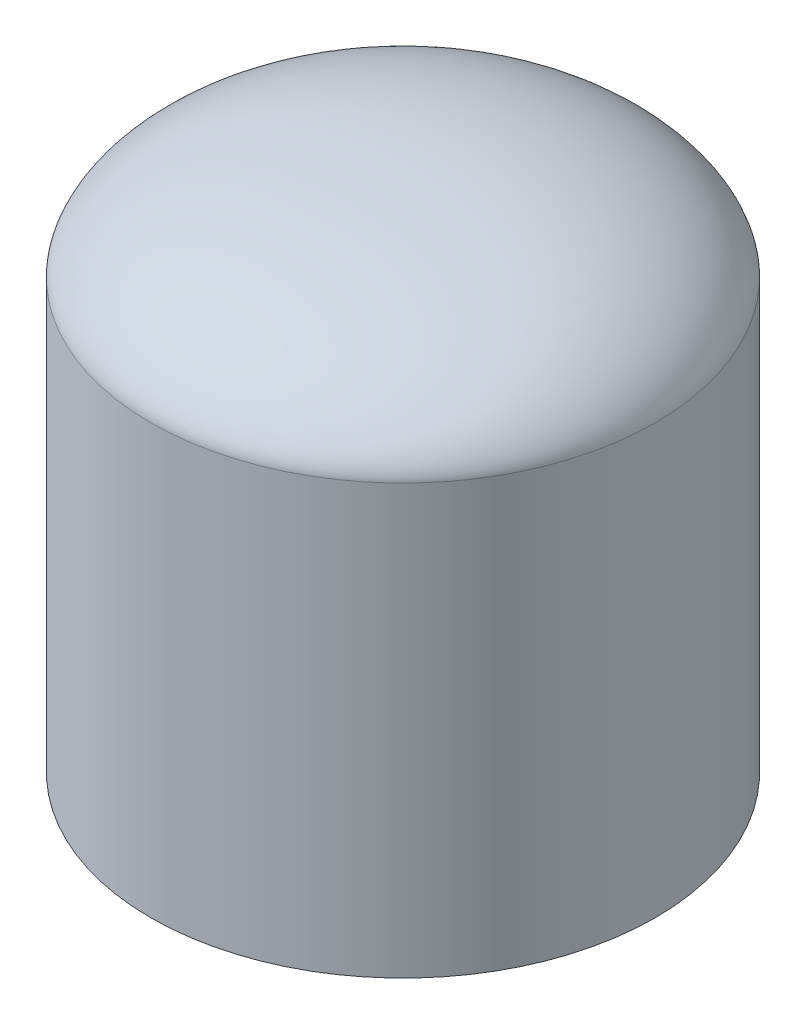
ISO-10303-21;
HEADER;
FILE_DESCRIPTION(('STEP AP214'),'2;1');
FILE_NAME('part.step','',(''),(''),'','','');
FILE_SCHEMA(('AUTOMOTIVE_DESIGN { 1 0 10303 214 1 1 1 1 }'));
ENDSEC;
DATA;
#1=APPLICATION_CONTEXT('core data for automotive mechanical design processes');
#2=APPLICATION_PROTOCOL_DEFINITION('international standard','automotive_design',2000,#1);
#3=PRODUCT_CONTEXT('',#1,'mechanical');
#4=PRODUCT('Part','Part','',(#3));
#5=PRODUCT_RELATED_PRODUCT_CATEGORY('part','',(#4));
#6=PRODUCT_DEFINITION_FORMATION('','',#4);
#7=PRODUCT_DEFINITION_CONTEXT('part definition',#1,'design');
#8=PRODUCT_DEFINITION('design','',#6,#7);
#9=PRODUCT_DEFINITION_SHAPE('','',#8);
#10=(LENGTH_UNIT() NAMED_UNIT(*) SI_UNIT(.MILLI.,.METRE.));
#11=(NAMED_UNIT(*) PLANE_ANGLE_UNIT() SI_UNIT($,.RADIAN.));
#12=(NAMED_UNIT(*) SI_UNIT($,.STERADIAN.) SOLID_ANGLE_UNIT());
#13=UNCERTAINTY_MEASURE_WITH_UNIT(LENGTH_MEASURE(1.E-05),#10,'distance_accuracy_value','');
#14=(GEOMETRIC_REPRESENTATION_CONTEXT(3) GLOBAL_UNCERTAINTY_ASSIGNED_CONTEXT((#13)) GLOBAL_UNIT_ASSIGNED_CONTEXT((#10,
#11,#12)) REPRESENTATION_CONTEXT('',''));
#15=CARTESIAN_POINT('',(0.,0.,0.));
#16=DIRECTION('',(0.,0.,1.));
#17=DIRECTION('',(1.,0.,0.));
#18=AXIS2_PLACEMENT_3D('',#15,#16,#17);
#19=CARTESIAN_POINT('',(0.,2.,0.));
#20=CARTESIAN_POINT('',(-3.81467429810746,2.,0.));
#21=CARTESIAN_POINT('',(-5.,0.453980542649606,0.));
#22=CARTESIAN_POINT('',(-5.,0.,0.));
#23=B_SPLINE_CURVE_WITH_KNOTS('',3,(#19,#20,#21,#22),.UNSPECIFIED.,.F.,.F.,(4,4),(0.,1.),.UNSPECIFIED.);
#24=CARTESIAN_POINT('',(0.,-8.5,0.));
#25=DIRECTION('',(0.,-1.,0.));
#26=AXIS1_PLACEMENT('',#24,#25);
#27=SURFACE_OF_REVOLUTION('',#23,#26);
#28=CARTESIAN_POINT('',(0.,0.,0.));
#29=DIRECTION('',(0.,-1.,0.));
#30=DIRECTION('',(0.,0.,-1.));
#31=AXIS2_PLACEMENT_3D('',#28,#29,#30);
#32=CIRCLE('',#31,5.);
#33=CARTESIAN_POINT('',(0.,0.,-5.));
#34=VERTEX_POINT('',#33);
#35=EDGE_CURVE('E47',#34,#34,#32,.T.);
#36=ORIENTED_EDGE('',*,*,#35,.F.);
#37=EDGE_LOOP('',(#36));
#38=FACE_BOUND('',#37,.T.);
#39=CARTESIAN_POINT('',(0.,2.,0.));
#40=VERTEX_POINT('',#39);
#41=VERTEX_LOOP('',#40);
#42=FACE_BOUND('',#41,.T.);
#43=ADVANCED_FACE('F39',(#38,#42),#27,.T.);
#44=CARTESIAN_POINT('',(-5.,-8.5,0.));
#45=DIRECTION('',(0.,1.,0.));
#46=DIRECTION('',(0.,0.,1.));
#47=AXIS2_PLACEMENT_3D('',#44,#45,#46);
#48=PLANE('',#47);
#49=CARTESIAN_POINT('',(0.,-8.5,0.));
#50=DIRECTION('',(0.,-1.,0.));
#51=DIRECTION('',(0.,0.,-1.));
#52=AXIS2_PLACEMENT_3D('',#49,#50,#51);
#53=CIRCLE('',#52,5.);
#54=CARTESIAN_POINT('',(0.,-8.5,-5.));
#55=VERTEX_POINT('',#54);
#56=EDGE_CURVE('E11',#55,#55,#53,.T.);
#57=ORIENTED_EDGE('',*,*,#56,.T.);
#58=EDGE_LOOP('',(#57));
#59=FACE_BOUND('',#58,.T.);
#60=ADVANCED_FACE('F51',(#59),#48,.F.);
#61=CARTESIAN_POINT('',(0.,-8.5,0.));
#62=DIRECTION('',(0.,-1.,0.));
#63=DIRECTION('',(0.,0.,-1.));
#64=AXIS2_PLACEMENT_3D('',#61,#62,#63);
#65=CYLINDRICAL_SURFACE('',#64,5.);
#66=ORIENTED_EDGE('',*,*,#56,.F.);
#67=EDGE_LOOP('',(#66));
#68=FACE_BOUND('',#67,.T.);
#69=ORIENTED_EDGE('',*,*,#35,.T.);
#70=EDGE_LOOP('',(#69));
#71=FACE_BOUND('',#70,.T.);
#72=ADVANCED_FACE('F56',(#68,#71),#65,.T.);
#73=CLOSED_SHELL('',(#43,#60,#72));
#74=MANIFOLD_SOLID_BREP('B2',#73);
#75=ADVANCED_BREP_SHAPE_REPRESENTATION('',(#18,#74),#14);
#76=SHAPE_DEFINITION_REPRESENTATION(#9,#75);
ENDSEC;
END-ISO-10303-21;
